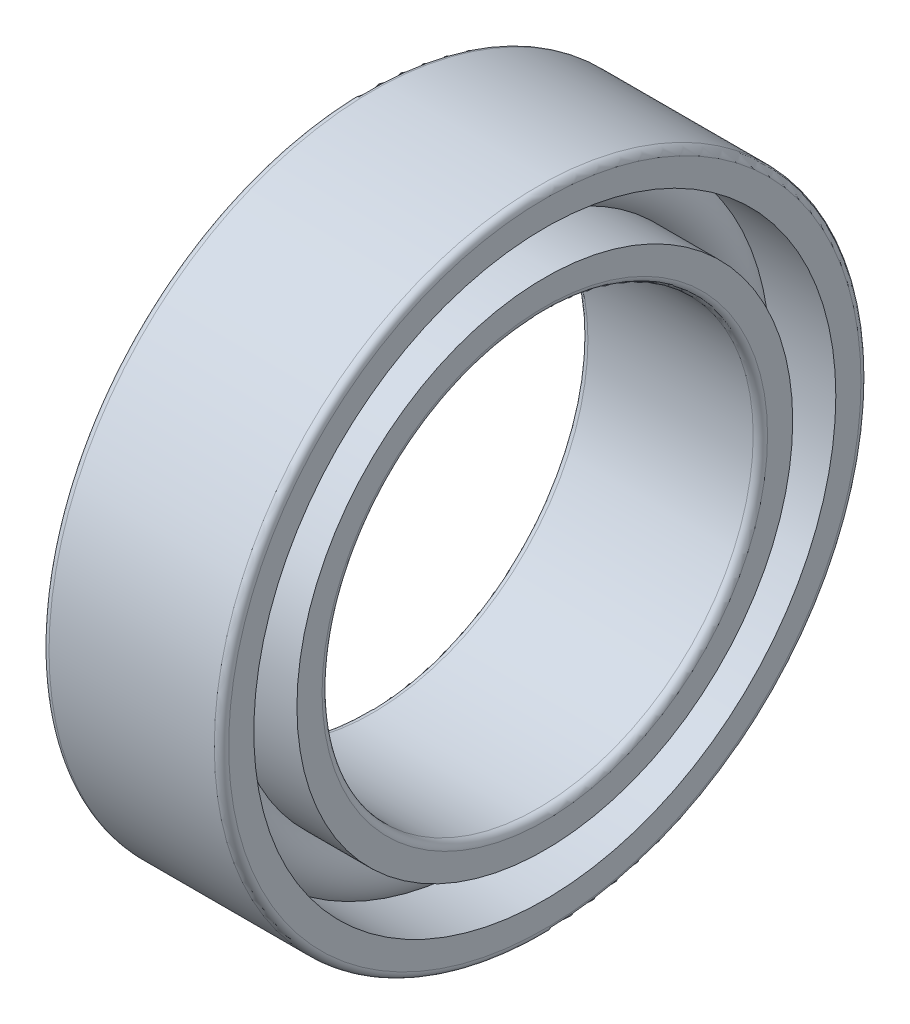
ISO-10303-21;
HEADER;
FILE_DESCRIPTION(('STEP AP214'),'2;1');
FILE_NAME('part.step','',(''),(''),'','','');
FILE_SCHEMA(('AUTOMOTIVE_DESIGN { 1 0 10303 214 1 1 1 1 }'));
ENDSEC;
DATA;
#1=APPLICATION_CONTEXT('core data for automotive mechanical design processes');
#2=APPLICATION_PROTOCOL_DEFINITION('international standard','automotive_design',2000,#1);
#3=PRODUCT_CONTEXT('',#1,'mechanical');
#4=PRODUCT('Part','Part','',(#3));
#5=PRODUCT_RELATED_PRODUCT_CATEGORY('part','',(#4));
#6=PRODUCT_DEFINITION_FORMATION('','',#4);
#7=PRODUCT_DEFINITION_CONTEXT('part definition',#1,'design');
#8=PRODUCT_DEFINITION('design','',#6,#7);
#9=PRODUCT_DEFINITION_SHAPE('','',#8);
#10=(LENGTH_UNIT() NAMED_UNIT(*) SI_UNIT(.MILLI.,.METRE.));
#11=(NAMED_UNIT(*) PLANE_ANGLE_UNIT() SI_UNIT($,.RADIAN.));
#12=(NAMED_UNIT(*) SI_UNIT($,.STERADIAN.) SOLID_ANGLE_UNIT());
#13=UNCERTAINTY_MEASURE_WITH_UNIT(LENGTH_MEASURE(1.E-05),#10,'distance_accuracy_value','');
#14=(GEOMETRIC_REPRESENTATION_CONTEXT(3) GLOBAL_UNCERTAINTY_ASSIGNED_CONTEXT((#13)) GLOBAL_UNIT_ASSIGNED_CONTEXT((#10,
#11,#12)) REPRESENTATION_CONTEXT('',''));
#15=CARTESIAN_POINT('',(0.,0.,0.));
#16=DIRECTION('',(0.,0.,1.));
#17=DIRECTION('',(1.,0.,0.));
#18=AXIS2_PLACEMENT_3D('',#15,#16,#17);
#19=CARTESIAN_POINT('',(0.,0.,0.));
#20=DIRECTION('',(-1.,0.,0.));
#21=DIRECTION('',(0.,0.,1.));
#22=AXIS2_PLACEMENT_3D('',#19,#20,#21);
#23=TOROIDAL_SURFACE('',#22,7.5,0.9);
#24=CARTESIAN_POINT('',(0.670820393249931,0.,0.));
#25=DIRECTION('',(-1.,0.,0.));
#26=DIRECTION('',(0.,0.,1.));
#27=AXIS2_PLACEMENT_3D('',#24,#25,#26);
#28=CIRCLE('',#27,8.10000000000001);
#29=CARTESIAN_POINT('',(0.670820393249931,0.,8.10000000000001));
#30=VERTEX_POINT('',#29);
#31=EDGE_CURVE('E41',#30,#30,#28,.F.);
#32=ORIENTED_EDGE('',*,*,#31,.T.);
#33=EDGE_LOOP('',(#32));
#34=FACE_BOUND('',#33,.T.);
#35=CARTESIAN_POINT('',(0.670820393249937,0.,0.));
#36=DIRECTION('',(-1.,0.,0.));
#37=DIRECTION('',(0.,0.,1.));
#38=AXIS2_PLACEMENT_3D('',#35,#36,#37);
#39=CIRCLE('',#38,6.9);
#40=CARTESIAN_POINT('',(0.670820393249937,0.,6.9));
#41=VERTEX_POINT('',#40);
#42=EDGE_CURVE('E10',#41,#41,#39,.T.);
#43=ORIENTED_EDGE('',*,*,#42,.T.);
#44=EDGE_LOOP('',(#43));
#45=FACE_BOUND('',#44,.T.);
#46=ADVANCED_FACE('F37',(#34,#45),#23,.T.);
#47=CARTESIAN_POINT('',(-20.6375,0.,0.));
#48=DIRECTION('',(1.,0.,0.));
#49=DIRECTION('',(0.,0.,-1.));
#50=AXIS2_PLACEMENT_3D('',#47,#48,#49);
#51=CYLINDRICAL_SURFACE('',#50,6.9);
#52=CARTESIAN_POINT('',(2.5,0.,0.));
#53=DIRECTION('',(1.,0.,0.));
#54=DIRECTION('',(0.,0.,-1.));
#55=AXIS2_PLACEMENT_3D('',#52,#53,#54);
#56=CIRCLE('',#55,6.9);
#57=CARTESIAN_POINT('',(2.5,0.,-6.9));
#58=VERTEX_POINT('',#57);
#59=EDGE_CURVE('E50',#58,#58,#56,.T.);
#60=ORIENTED_EDGE('',*,*,#59,.F.);
#61=EDGE_LOOP('',(#60));
#62=FACE_BOUND('',#61,.T.);
#63=ORIENTED_EDGE('',*,*,#42,.F.);
#64=EDGE_LOOP('',(#63));
#65=FACE_BOUND('',#64,.T.);
#66=ADVANCED_FACE('F89',(#62,#65),#51,.T.);
#67=CARTESIAN_POINT('',(-20.6375,0.,0.));
#68=DIRECTION('',(1.,0.,0.));
#69=DIRECTION('',(0.,0.,-1.));
#70=AXIS2_PLACEMENT_3D('',#67,#68,#69);
#71=CYLINDRICAL_SURFACE('',#70,6.9);
#72=CARTESIAN_POINT('',(-2.5,0.,0.));
#73=DIRECTION('',(1.,0.,0.));
#74=DIRECTION('',(0.,0.,-1.));
#75=AXIS2_PLACEMENT_3D('',#72,#73,#74);
#76=CIRCLE('',#75,6.9);
#77=CARTESIAN_POINT('',(-2.5,0.,-6.9));
#78=VERTEX_POINT('',#77);
#79=EDGE_CURVE('E59',#78,#78,#76,.T.);
#80=ORIENTED_EDGE('',*,*,#79,.T.);
#81=EDGE_LOOP('',(#80));
#82=FACE_BOUND('',#81,.T.);
#83=CARTESIAN_POINT('',(-0.670820393249937,0.,0.));
#84=DIRECTION('',(1.,0.,0.));
#85=DIRECTION('',(0.,0.,-1.));
#86=AXIS2_PLACEMENT_3D('',#83,#84,#85);
#87=CIRCLE('',#86,6.9);
#88=CARTESIAN_POINT('',(-0.670820393249937,0.,-6.9));
#89=VERTEX_POINT('',#88);
#90=EDGE_CURVE('E45',#89,#89,#87,.T.);
#91=ORIENTED_EDGE('',*,*,#90,.F.);
#92=EDGE_LOOP('',(#91));
#93=FACE_BOUND('',#92,.T.);
#94=ADVANCED_FACE('F92',(#82,#93),#71,.T.);
#95=CARTESIAN_POINT('',(2.5,6.2,0.));
#96=DIRECTION('',(1.,0.,0.));
#97=DIRECTION('',(0.,0.,-1.));
#98=AXIS2_PLACEMENT_3D('',#95,#96,#97);
#99=PLANE('',#98);
#100=ORIENTED_EDGE('',*,*,#59,.T.);
#101=EDGE_LOOP('',(#100));
#102=FACE_BOUND('',#101,.T.);
#103=CARTESIAN_POINT('',(2.5,0.,0.));
#104=DIRECTION('',(1.,0.,0.));
#105=DIRECTION('',(0.,0.,-1.));
#106=AXIS2_PLACEMENT_3D('',#103,#104,#105);
#107=CIRCLE('',#106,6.2);
#108=CARTESIAN_POINT('',(2.5,0.,-6.2));
#109=VERTEX_POINT('',#108);
#110=EDGE_CURVE('E81',#109,#109,#107,.T.);
#111=ORIENTED_EDGE('',*,*,#110,.F.);
#112=EDGE_LOOP('',(#111));
#113=FACE_BOUND('',#112,.T.);
#114=ADVANCED_FACE('F86',(#102,#113),#99,.T.);
#115=CARTESIAN_POINT('',(2.3,0.,0.));
#116=DIRECTION('',(1.,0.,0.));
#117=DIRECTION('',(0.,0.,-1.));
#118=AXIS2_PLACEMENT_3D('',#115,#116,#117);
#119=TOROIDAL_SURFACE('',#118,6.2,0.2);
#120=ORIENTED_EDGE('',*,*,#110,.T.);
#121=EDGE_LOOP('',(#120));
#122=FACE_BOUND('',#121,.T.);
#123=CARTESIAN_POINT('',(2.3,0.,0.));
#124=DIRECTION('',(1.,0.,0.));
#125=DIRECTION('',(0.,0.,-1.));
#126=AXIS2_PLACEMENT_3D('',#123,#124,#125);
#127=CIRCLE('',#126,6.);
#128=CARTESIAN_POINT('',(2.3,0.,-6.));
#129=VERTEX_POINT('',#128);
#130=EDGE_CURVE('E78',#129,#129,#127,.T.);
#131=ORIENTED_EDGE('',*,*,#130,.F.);
#132=EDGE_LOOP('',(#131));
#133=FACE_BOUND('',#132,.T.);
#134=ADVANCED_FACE('F103',(#122,#133),#119,.T.);
#135=CARTESIAN_POINT('',(-20.6375,0.,0.));
#136=DIRECTION('',(1.,0.,0.));
#137=DIRECTION('',(0.,0.,-1.));
#138=AXIS2_PLACEMENT_3D('',#135,#136,#137);
#139=CYLINDRICAL_SURFACE('',#138,6.);
#140=ORIENTED_EDGE('',*,*,#130,.T.);
#141=EDGE_LOOP('',(#140));
#142=FACE_BOUND('',#141,.T.);
#143=CARTESIAN_POINT('',(-2.3,0.,0.));
#144=DIRECTION('',(1.,0.,0.));
#145=DIRECTION('',(0.,0.,-1.));
#146=AXIS2_PLACEMENT_3D('',#143,#144,#145);
#147=CIRCLE('',#146,6.);
#148=CARTESIAN_POINT('',(-2.3,0.,-6.));
#149=VERTEX_POINT('',#148);
#150=EDGE_CURVE('E75',#149,#149,#147,.T.);
#151=ORIENTED_EDGE('',*,*,#150,.F.);
#152=EDGE_LOOP('',(#151));
#153=FACE_BOUND('',#152,.T.);
#154=ADVANCED_FACE('F106',(#142,#153),#139,.F.);
#155=CARTESIAN_POINT('',(-2.3,0.,0.));
#156=DIRECTION('',(1.,0.,0.));
#157=DIRECTION('',(0.,0.,-1.));
#158=AXIS2_PLACEMENT_3D('',#155,#156,#157);
#159=TOROIDAL_SURFACE('',#158,6.2,0.2);
#160=ORIENTED_EDGE('',*,*,#150,.T.);
#161=EDGE_LOOP('',(#160));
#162=FACE_BOUND('',#161,.T.);
#163=CARTESIAN_POINT('',(-2.5,0.,0.));
#164=DIRECTION('',(1.,0.,0.));
#165=DIRECTION('',(0.,0.,-1.));
#166=AXIS2_PLACEMENT_3D('',#163,#164,#165);
#167=CIRCLE('',#166,6.2);
#168=CARTESIAN_POINT('',(-2.5,0.,-6.2));
#169=VERTEX_POINT('',#168);
#170=EDGE_CURVE('E72',#169,#169,#167,.T.);
#171=ORIENTED_EDGE('',*,*,#170,.F.);
#172=EDGE_LOOP('',(#171));
#173=FACE_BOUND('',#172,.T.);
#174=ADVANCED_FACE('F110',(#162,#173),#159,.T.);
#175=CARTESIAN_POINT('',(-2.5,6.9,0.));
#176=DIRECTION('',(-1.,0.,0.));
#177=DIRECTION('',(0.,0.,1.));
#178=AXIS2_PLACEMENT_3D('',#175,#176,#177);
#179=PLANE('',#178);
#180=ORIENTED_EDGE('',*,*,#170,.T.);
#181=EDGE_LOOP('',(#180));
#182=FACE_BOUND('',#181,.T.);
#183=ORIENTED_EDGE('',*,*,#79,.F.);
#184=EDGE_LOOP('',(#183));
#185=FACE_BOUND('',#184,.T.);
#186=ADVANCED_FACE('F114',(#182,#185),#179,.T.);
#187=CARTESIAN_POINT('',(-0.670820393249931,0.,0.));
#188=DIRECTION('',(1.,0.,0.));
#189=DIRECTION('',(0.,0.,-1.));
#190=AXIS2_PLACEMENT_3D('',#187,#188,#189);
#191=CIRCLE('',#190,8.10000000000001);
#192=CARTESIAN_POINT('',(-0.670820393249931,0.,-8.10000000000001));
#193=VERTEX_POINT('',#192);
#194=EDGE_CURVE('E53',#193,#193,#191,.F.);
#195=ORIENTED_EDGE('',*,*,#194,.T.);
#196=EDGE_LOOP('',(#195));
#197=FACE_BOUND('',#196,.T.);
#198=ORIENTED_EDGE('',*,*,#90,.T.);
#199=EDGE_LOOP('',(#198));
#200=FACE_BOUND('',#199,.T.);
#201=ADVANCED_FACE('F39',(#197,#200),#23,.T.);
#202=CARTESIAN_POINT('',(-20.6375,0.,0.));
#203=DIRECTION('',(1.,0.,0.));
#204=DIRECTION('',(0.,0.,-1.));
#205=AXIS2_PLACEMENT_3D('',#202,#203,#204);
#206=CYLINDRICAL_SURFACE('',#205,8.10000000000001);
#207=CARTESIAN_POINT('',(2.5,0.,0.));
#208=DIRECTION('',(1.,0.,0.));
#209=DIRECTION('',(0.,0.,-1.));
#210=AXIS2_PLACEMENT_3D('',#207,#208,#209);
#211=CIRCLE('',#210,8.1);
#212=CARTESIAN_POINT('',(2.5,0.,-8.1));
#213=VERTEX_POINT('',#212);
#214=EDGE_CURVE('E55',#213,#213,#211,.T.);
#215=ORIENTED_EDGE('',*,*,#214,.T.);
#216=EDGE_LOOP('',(#215));
#217=FACE_BOUND('',#216,.T.);
#218=ORIENTED_EDGE('',*,*,#31,.F.);
#219=EDGE_LOOP('',(#218));
#220=FACE_BOUND('',#219,.T.);
#221=ADVANCED_FACE('F119',(#217,#220),#206,.F.);
#222=CARTESIAN_POINT('',(-20.6375,0.,0.));
#223=DIRECTION('',(1.,0.,0.));
#224=DIRECTION('',(0.,0.,-1.));
#225=AXIS2_PLACEMENT_3D('',#222,#223,#224);
#226=CYLINDRICAL_SURFACE('',#225,8.10000000000001);
#227=CARTESIAN_POINT('',(-2.5,0.,0.));
#228=DIRECTION('',(1.,0.,0.));
#229=DIRECTION('',(0.,0.,-1.));
#230=AXIS2_PLACEMENT_3D('',#227,#228,#229);
#231=CIRCLE('',#230,8.1);
#232=CARTESIAN_POINT('',(-2.5,0.,-8.1));
#233=VERTEX_POINT('',#232);
#234=EDGE_CURVE('E150',#233,#233,#231,.T.);
#235=ORIENTED_EDGE('',*,*,#234,.F.);
#236=EDGE_LOOP('',(#235));
#237=FACE_BOUND('',#236,.T.);
#238=ORIENTED_EDGE('',*,*,#194,.F.);
#239=EDGE_LOOP('',(#238));
#240=FACE_BOUND('',#239,.T.);
#241=ADVANCED_FACE('F122',(#237,#240),#226,.F.);
#242=CARTESIAN_POINT('',(2.5,8.8,0.));
#243=DIRECTION('',(1.,0.,0.));
#244=DIRECTION('',(0.,0.,-1.));
#245=AXIS2_PLACEMENT_3D('',#242,#243,#244);
#246=PLANE('',#245);
#247=CARTESIAN_POINT('',(2.5,0.,0.));
#248=DIRECTION('',(1.,0.,0.));
#249=DIRECTION('',(0.,0.,-1.));
#250=AXIS2_PLACEMENT_3D('',#247,#248,#249);
#251=CIRCLE('',#250,8.8);
#252=CARTESIAN_POINT('',(2.5,0.,-8.8));
#253=VERTEX_POINT('',#252);
#254=EDGE_CURVE('E61',#253,#253,#251,.T.);
#255=ORIENTED_EDGE('',*,*,#254,.T.);
#256=EDGE_LOOP('',(#255));
#257=FACE_BOUND('',#256,.T.);
#258=ORIENTED_EDGE('',*,*,#214,.F.);
#259=EDGE_LOOP('',(#258));
#260=FACE_BOUND('',#259,.T.);
#261=ADVANCED_FACE('F123',(#257,#260),#246,.T.);
#262=CARTESIAN_POINT('',(2.3,0.,0.));
#263=DIRECTION('',(1.,0.,0.));
#264=DIRECTION('',(0.,0.,-1.));
#265=AXIS2_PLACEMENT_3D('',#262,#263,#264);
#266=TOROIDAL_SURFACE('',#265,8.8,0.2);
#267=CARTESIAN_POINT('',(2.3,0.,0.));
#268=DIRECTION('',(1.,0.,0.));
#269=DIRECTION('',(0.,0.,-1.));
#270=AXIS2_PLACEMENT_3D('',#267,#268,#269);
#271=CIRCLE('',#270,9.);
#272=CARTESIAN_POINT('',(2.3,0.,-9.));
#273=VERTEX_POINT('',#272);
#274=EDGE_CURVE('E66',#273,#273,#271,.T.);
#275=ORIENTED_EDGE('',*,*,#274,.T.);
#276=EDGE_LOOP('',(#275));
#277=FACE_BOUND('',#276,.T.);
#278=ORIENTED_EDGE('',*,*,#254,.F.);
#279=EDGE_LOOP('',(#278));
#280=FACE_BOUND('',#279,.T.);
#281=ADVANCED_FACE('F126',(#277,#280),#266,.T.);
#282=CARTESIAN_POINT('',(-20.6375,0.,0.));
#283=DIRECTION('',(1.,0.,0.));
#284=DIRECTION('',(0.,0.,-1.));
#285=AXIS2_PLACEMENT_3D('',#282,#283,#284);
#286=CYLINDRICAL_SURFACE('',#285,9.);
#287=CARTESIAN_POINT('',(-2.3,0.,0.));
#288=DIRECTION('',(1.,0.,0.));
#289=DIRECTION('',(0.,0.,-1.));
#290=AXIS2_PLACEMENT_3D('',#287,#288,#289);
#291=CIRCLE('',#290,9.);
#292=CARTESIAN_POINT('',(-2.3,0.,-9.));
#293=VERTEX_POINT('',#292);
#294=EDGE_CURVE('E154',#293,#293,#291,.T.);
#295=ORIENTED_EDGE('',*,*,#294,.T.);
#296=EDGE_LOOP('',(#295));
#297=FACE_BOUND('',#296,.T.);
#298=ORIENTED_EDGE('',*,*,#274,.F.);
#299=EDGE_LOOP('',(#298));
#300=FACE_BOUND('',#299,.T.);
#301=ADVANCED_FACE('F130',(#297,#300),#286,.T.);
#302=CARTESIAN_POINT('',(-2.3,0.,0.));
#303=DIRECTION('',(1.,0.,0.));
#304=DIRECTION('',(0.,0.,-1.));
#305=AXIS2_PLACEMENT_3D('',#302,#303,#304);
#306=TOROIDAL_SURFACE('',#305,8.8,0.2);
#307=CARTESIAN_POINT('',(-2.5,0.,0.));
#308=DIRECTION('',(1.,0.,0.));
#309=DIRECTION('',(0.,0.,-1.));
#310=AXIS2_PLACEMENT_3D('',#307,#308,#309);
#311=CIRCLE('',#310,8.8);
#312=CARTESIAN_POINT('',(-2.5,0.,-8.8));
#313=VERTEX_POINT('',#312);
#314=EDGE_CURVE('E151',#313,#313,#311,.T.);
#315=ORIENTED_EDGE('',*,*,#314,.T.);
#316=EDGE_LOOP('',(#315));
#317=FACE_BOUND('',#316,.T.);
#318=ORIENTED_EDGE('',*,*,#294,.F.);
#319=EDGE_LOOP('',(#318));
#320=FACE_BOUND('',#319,.T.);
#321=ADVANCED_FACE('F134',(#317,#320),#306,.T.);
#322=CARTESIAN_POINT('',(-2.5,8.1,0.));
#323=DIRECTION('',(-1.,0.,0.));
#324=DIRECTION('',(0.,0.,1.));
#325=AXIS2_PLACEMENT_3D('',#322,#323,#324);
#326=PLANE('',#325);
#327=ORIENTED_EDGE('',*,*,#234,.T.);
#328=EDGE_LOOP('',(#327));
#329=FACE_BOUND('',#328,.T.);
#330=ORIENTED_EDGE('',*,*,#314,.F.);
#331=EDGE_LOOP('',(#330));
#332=FACE_BOUND('',#331,.T.);
#333=ADVANCED_FACE('F138',(#329,#332),#326,.T.);
#334=CLOSED_SHELL('',(#46,#66,#94,#114,#134,#154,#174,#186,#201,#221,#241,#261,#281,#301,#321,#333));
#335=MANIFOLD_SOLID_BREP('B2',#334);
#336=ADVANCED_BREP_SHAPE_REPRESENTATION('',(#18,#335),#14);
#337=SHAPE_DEFINITION_REPRESENTATION(#9,#336);
ENDSEC;
END-ISO-10303-21;
